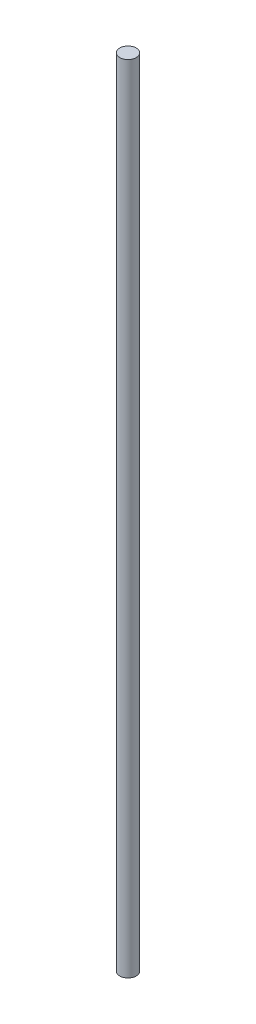
ISO-10303-21;
HEADER;
FILE_DESCRIPTION(('STEP AP214'),'2;1');
FILE_NAME('part.step','',(''),(''),'','','');
FILE_SCHEMA(('AUTOMOTIVE_DESIGN { 1 0 10303 214 1 1 1 1 }'));
ENDSEC;
DATA;
#1=APPLICATION_CONTEXT('core data for automotive mechanical design processes');
#2=APPLICATION_PROTOCOL_DEFINITION('international standard','automotive_design',2000,#1);
#3=PRODUCT_CONTEXT('',#1,'mechanical');
#4=PRODUCT('Part','Part','',(#3));
#5=PRODUCT_RELATED_PRODUCT_CATEGORY('part','',(#4));
#6=PRODUCT_DEFINITION_FORMATION('','',#4);
#7=PRODUCT_DEFINITION_CONTEXT('part definition',#1,'design');
#8=PRODUCT_DEFINITION('design','',#6,#7);
#9=PRODUCT_DEFINITION_SHAPE('','',#8);
#10=(LENGTH_UNIT() NAMED_UNIT(*) SI_UNIT(.MILLI.,.METRE.));
#11=(NAMED_UNIT(*) PLANE_ANGLE_UNIT() SI_UNIT($,.RADIAN.));
#12=(NAMED_UNIT(*) SI_UNIT($,.STERADIAN.) SOLID_ANGLE_UNIT());
#13=UNCERTAINTY_MEASURE_WITH_UNIT(LENGTH_MEASURE(1.E-05),#10,'distance_accuracy_value','');
#14=(GEOMETRIC_REPRESENTATION_CONTEXT(3) GLOBAL_UNCERTAINTY_ASSIGNED_CONTEXT((#13)) GLOBAL_UNIT_ASSIGNED_CONTEXT((#10,
#11,#12)) REPRESENTATION_CONTEXT('',''));
#15=CARTESIAN_POINT('',(0.,0.,0.));
#16=DIRECTION('',(0.,0.,1.));
#17=DIRECTION('',(1.,0.,0.));
#18=AXIS2_PLACEMENT_3D('',#15,#16,#17);
#19=CARTESIAN_POINT('',(0.,1828.8,0.));
#20=DIRECTION('',(0.,-1.,0.));
#21=DIRECTION('',(0.,0.,-1.));
#22=AXIS2_PLACEMENT_3D('',#19,#20,#21);
#23=CYLINDRICAL_SURFACE('',#22,19.05);
#24=CARTESIAN_POINT('',(0.,1828.8,0.));
#25=DIRECTION('',(0.,1.,0.));
#26=DIRECTION('',(0.,0.,1.));
#27=AXIS2_PLACEMENT_3D('',#24,#25,#26);
#28=CIRCLE('',#27,19.05);
#29=CARTESIAN_POINT('',(0.,1828.8,19.05));
#30=VERTEX_POINT('',#29);
#31=EDGE_CURVE('E10',#30,#30,#28,.T.);
#32=ORIENTED_EDGE('',*,*,#31,.F.);
#33=EDGE_LOOP('',(#32));
#34=FACE_BOUND('',#33,.T.);
#35=CARTESIAN_POINT('',(0.,0.,0.));
#36=DIRECTION('',(0.,1.,0.));
#37=DIRECTION('',(0.,0.,1.));
#38=AXIS2_PLACEMENT_3D('',#35,#36,#37);
#39=CIRCLE('',#38,19.05);
#40=CARTESIAN_POINT('',(0.,0.,19.05));
#41=VERTEX_POINT('',#40);
#42=EDGE_CURVE('E34',#41,#41,#39,.T.);
#43=ORIENTED_EDGE('',*,*,#42,.T.);
#44=EDGE_LOOP('',(#43));
#45=FACE_BOUND('',#44,.T.);
#46=ADVANCED_FACE('F31',(#34,#45),#23,.T.);
#47=CARTESIAN_POINT('',(0.,1828.8,0.));
#48=DIRECTION('',(0.,1.,0.));
#49=DIRECTION('',(0.,0.,1.));
#50=AXIS2_PLACEMENT_3D('',#47,#48,#49);
#51=PLANE('',#50);
#52=ORIENTED_EDGE('',*,*,#31,.T.);
#53=EDGE_LOOP('',(#52));
#54=FACE_BOUND('',#53,.T.);
#55=ADVANCED_FACE('F46',(#54),#51,.T.);
#56=CARTESIAN_POINT('',(0.,0.,0.));
#57=DIRECTION('',(0.,1.,0.));
#58=DIRECTION('',(0.,0.,1.));
#59=AXIS2_PLACEMENT_3D('',#56,#57,#58);
#60=PLANE('',#59);
#61=ORIENTED_EDGE('',*,*,#42,.F.);
#62=EDGE_LOOP('',(#61));
#63=FACE_BOUND('',#62,.T.);
#64=ADVANCED_FACE('F44',(#63),#60,.F.);
#65=CLOSED_SHELL('',(#46,#55,#64));
#66=MANIFOLD_SOLID_BREP('B2',#65);
#67=ADVANCED_BREP_SHAPE_REPRESENTATION('',(#18,#66),#14);
#68=SHAPE_DEFINITION_REPRESENTATION(#9,#67);
ENDSEC;
END-ISO-10303-21;
